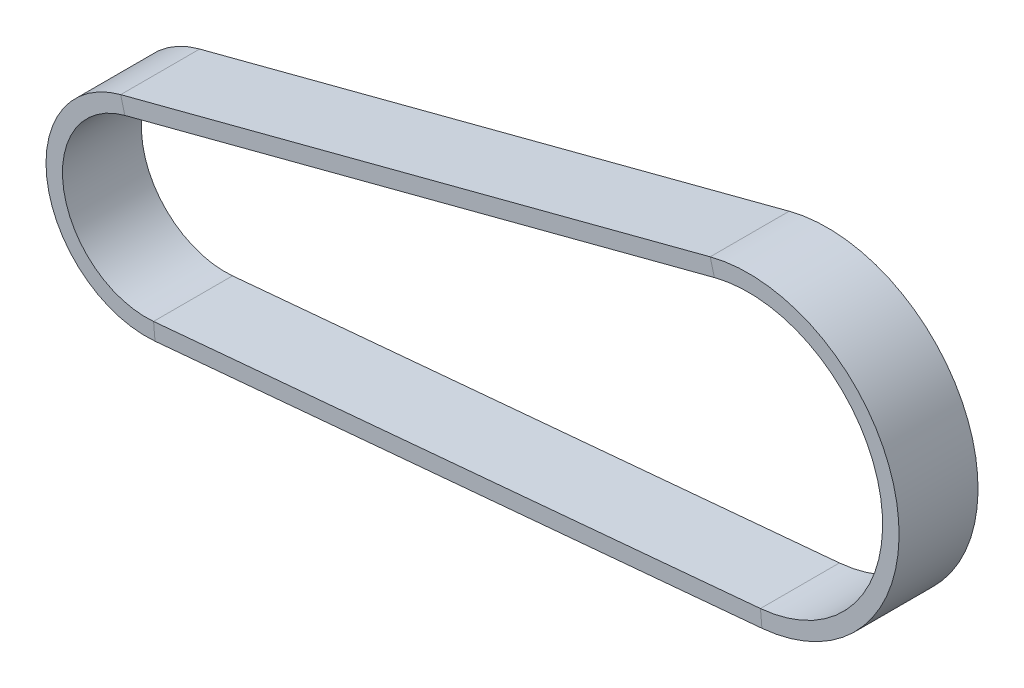
ISO-10303-21;
HEADER;
FILE_DESCRIPTION(('STEP AP214'),'2;1');
FILE_NAME('part.step','',(''),(''),'','','');
FILE_SCHEMA(('AUTOMOTIVE_DESIGN { 1 0 10303 214 1 1 1 1 }'));
ENDSEC;
DATA;
#1=APPLICATION_CONTEXT('core data for automotive mechanical design processes');
#2=APPLICATION_PROTOCOL_DEFINITION('international standard','automotive_design',2000,#1);
#3=PRODUCT_CONTEXT('',#1,'mechanical');
#4=PRODUCT('Part','Part','',(#3));
#5=PRODUCT_RELATED_PRODUCT_CATEGORY('part','',(#4));
#6=PRODUCT_DEFINITION_FORMATION('','',#4);
#7=PRODUCT_DEFINITION_CONTEXT('part definition',#1,'design');
#8=PRODUCT_DEFINITION('design','',#6,#7);
#9=PRODUCT_DEFINITION_SHAPE('','',#8);
#10=(LENGTH_UNIT() NAMED_UNIT(*) SI_UNIT(.MILLI.,.METRE.));
#11=(NAMED_UNIT(*) PLANE_ANGLE_UNIT() SI_UNIT($,.RADIAN.));
#12=(NAMED_UNIT(*) SI_UNIT($,.STERADIAN.) SOLID_ANGLE_UNIT());
#13=UNCERTAINTY_MEASURE_WITH_UNIT(LENGTH_MEASURE(1.E-05),#10,'distance_accuracy_value','');
#14=(GEOMETRIC_REPRESENTATION_CONTEXT(3) GLOBAL_UNCERTAINTY_ASSIGNED_CONTEXT((#13)) GLOBAL_UNIT_ASSIGNED_CONTEXT((#10,
#11,#12)) REPRESENTATION_CONTEXT('',''));
#15=CARTESIAN_POINT('',(0.,0.,0.));
#16=DIRECTION('',(0.,0.,1.));
#17=DIRECTION('',(1.,0.,0.));
#18=AXIS2_PLACEMENT_3D('',#15,#16,#17);
#19=CARTESIAN_POINT('',(-2.89942425296756,11.0768153817469,3.));
#20=DIRECTION('',(0.,0.,1.));
#21=DIRECTION('',(1.,0.,0.));
#22=AXIS2_PLACEMENT_3D('',#19,#20,#21);
#23=PLANE('',#22);
#24=CARTESIAN_POINT('',(0.,0.,3.));
#25=DIRECTION('',(0.,0.,-1.));
#26=DIRECTION('',(-0.253224825586686,0.967407456921122,0.));
#27=AXIS2_PLACEMENT_3D('',#24,#25,#26);
#28=CIRCLE('',#27,11.45);
#29=CARTESIAN_POINT('',(-2.89942425296755,11.0768153817469,3.));
#30=VERTEX_POINT('',#29);
#31=CARTESIAN_POINT('',(1.03013866200487,-11.4035658606001,3.));
#32=VERTEX_POINT('',#31);
#33=EDGE_CURVE('E11',#30,#32,#28,.T.);
#34=ORIENTED_EDGE('',*,*,#33,.F.);
#35=DIRECTION('',(0.253224825586685,-0.967407456921122,0.));
#36=VECTOR('',#35,1.);
#37=CARTESIAN_POINT('',(-2.89942425296755,11.0768153817469,3.));
#38=LINE('',#37,#36);
#39=CARTESIAN_POINT('',(-2.5828932209842,9.86755606059545,3.));
#40=VERTEX_POINT('',#39);
#41=EDGE_CURVE('E36',#30,#40,#38,.T.);
#42=ORIENTED_EDGE('',*,*,#41,.T.);
#43=CARTESIAN_POINT('',(0.,0.,3.));
#44=DIRECTION('',(0.,0.,-1.));
#45=DIRECTION('',(-0.253224825586686,0.967407456921122,0.));
#46=AXIS2_PLACEMENT_3D('',#43,#44,#45);
#47=CIRCLE('',#46,10.2);
#48=CARTESIAN_POINT('',(0.917678109384255,-10.1586350897922,3.));
#49=VERTEX_POINT('',#48);
#50=EDGE_CURVE('E118',#40,#49,#47,.T.);
#51=ORIENTED_EDGE('',*,*,#50,.T.);
#52=DIRECTION('',(-0.0899684420964954,0.995944616646292,0.));
#53=VECTOR('',#52,1.);
#54=CARTESIAN_POINT('',(1.03013866200487,-11.4035658606001,3.));
#55=LINE('',#54,#53);
#56=EDGE_CURVE('E121',#32,#49,#55,.T.);
#57=ORIENTED_EDGE('',*,*,#56,.F.);
#58=EDGE_LOOP('',(#34,#42,#51,#57));
#59=FACE_BOUND('',#58,.T.);
#60=ADVANCED_FACE('F33',(#59),#23,.T.);
#61=CARTESIAN_POINT('',(0.,0.,0.));
#62=DIRECTION('',(0.,0.,-1.));
#63=DIRECTION('',(-1.,0.,0.));
#64=AXIS2_PLACEMENT_3D('',#61,#62,#63);
#65=CYLINDRICAL_SURFACE('',#64,11.45);
#66=CARTESIAN_POINT('',(0.,0.,-3.));
#67=DIRECTION('',(0.,0.,-1.));
#68=DIRECTION('',(-0.253224825586686,0.967407456921122,0.));
#69=AXIS2_PLACEMENT_3D('',#66,#67,#68);
#70=CIRCLE('',#69,11.45);
#71=CARTESIAN_POINT('',(-2.89942425296755,11.0768153817469,-3.));
#72=VERTEX_POINT('',#71);
#73=CARTESIAN_POINT('',(1.03013866200487,-11.4035658606001,-3.));
#74=VERTEX_POINT('',#73);
#75=EDGE_CURVE('E41',#72,#74,#70,.T.);
#76=ORIENTED_EDGE('',*,*,#75,.F.);
#77=DIRECTION('',(0.,0.,1.));
#78=VECTOR('',#77,1.);
#79=CARTESIAN_POINT('',(-2.89942425296755,11.0768153817469,3.));
#80=LINE('',#79,#78);
#81=EDGE_CURVE('E187',#72,#30,#80,.T.);
#82=ORIENTED_EDGE('',*,*,#81,.T.);
#83=ORIENTED_EDGE('',*,*,#33,.T.);
#84=DIRECTION('',(0.,0.,1.));
#85=VECTOR('',#84,1.);
#86=CARTESIAN_POINT('',(1.03013866200487,-11.4035658606001,3.));
#87=LINE('',#86,#85);
#88=EDGE_CURVE('E146',#74,#32,#87,.T.);
#89=ORIENTED_EDGE('',*,*,#88,.F.);
#90=EDGE_LOOP('',(#76,#82,#83,#89));
#91=FACE_BOUND('',#90,.T.);
#92=ADVANCED_FACE('F227',(#91),#65,.T.);
#93=CARTESIAN_POINT('',(-2.89942425296755,11.0768153817469,-3.));
#94=DIRECTION('',(0.,0.,-1.));
#95=DIRECTION('',(-1.,0.,0.));
#96=AXIS2_PLACEMENT_3D('',#93,#94,#95);
#97=PLANE('',#96);
#98=CARTESIAN_POINT('',(0.,0.,-3.));
#99=DIRECTION('',(0.,0.,-1.));
#100=DIRECTION('',(-0.253224825586686,0.967407456921122,0.));
#101=AXIS2_PLACEMENT_3D('',#98,#99,#100);
#102=CIRCLE('',#101,10.2);
#103=CARTESIAN_POINT('',(-2.5828932209842,9.86755606059545,-3.));
#104=VERTEX_POINT('',#103);
#105=CARTESIAN_POINT('',(0.917678109384255,-10.1586350897922,-3.));
#106=VERTEX_POINT('',#105);
#107=EDGE_CURVE('E127',#104,#106,#102,.T.);
#108=ORIENTED_EDGE('',*,*,#107,.F.);
#109=DIRECTION('',(-0.253224825586685,0.967407456921122,0.));
#110=VECTOR('',#109,1.);
#111=CARTESIAN_POINT('',(-2.89942425296755,11.0768153817469,-3.));
#112=LINE('',#111,#110);
#113=EDGE_CURVE('E171',#104,#72,#112,.T.);
#114=ORIENTED_EDGE('',*,*,#113,.T.);
#115=ORIENTED_EDGE('',*,*,#75,.T.);
#116=DIRECTION('',(0.0899684420964956,-0.995944616646292,0.));
#117=VECTOR('',#116,1.);
#118=CARTESIAN_POINT('',(1.03013866200487,-11.4035658606001,-3.));
#119=LINE('',#118,#117);
#120=EDGE_CURVE('E151',#106,#74,#119,.T.);
#121=ORIENTED_EDGE('',*,*,#120,.F.);
#122=EDGE_LOOP('',(#108,#114,#115,#121));
#123=FACE_BOUND('',#122,.T.);
#124=ADVANCED_FACE('F223',(#123),#97,.T.);
#125=CARTESIAN_POINT('',(-47.691189048385,-0.647703327399525,3.));
#126=DIRECTION('',(0.,0.,1.));
#127=DIRECTION('',(1.,0.,0.));
#128=AXIS2_PLACEMENT_3D('',#125,#126,#127);
#129=PLANE('',#128);
#130=ORIENTED_EDGE('',*,*,#41,.F.);
#131=DIRECTION('',(0.967407456921122,0.253224825586685,0.));
#132=VECTOR('',#131,1.);
#133=CARTESIAN_POINT('',(-47.691189048385,-0.647703327399525,3.));
#134=LINE('',#133,#132);
#135=CARTESIAN_POINT('',(-47.691189048385,-0.647703327399528,3.));
#136=VERTEX_POINT('',#135);
#137=EDGE_CURVE('E49',#136,#30,#134,.T.);
#138=ORIENTED_EDGE('',*,*,#137,.F.);
#139=DIRECTION('',(0.253224825586685,-0.967407456921122,0.));
#140=VECTOR('',#139,1.);
#141=CARTESIAN_POINT('',(-47.691189048385,-0.647703327399525,3.));
#142=LINE('',#141,#140);
#143=CARTESIAN_POINT('',(-47.3746580164017,-1.85696264855093,3.));
#144=VERTEX_POINT('',#143);
#145=EDGE_CURVE('E175',#136,#144,#142,.T.);
#146=ORIENTED_EDGE('',*,*,#145,.T.);
#147=DIRECTION('',(0.967407456921122,0.253224825586685,0.));
#148=VECTOR('',#147,1.);
#149=CARTESIAN_POINT('',(-47.3746580164017,-1.85696264855093,3.));
#150=LINE('',#149,#148);
#151=EDGE_CURVE('E173',#144,#40,#150,.T.);
#152=ORIENTED_EDGE('',*,*,#151,.T.);
#153=EDGE_LOOP('',(#130,#138,#146,#152));
#154=FACE_BOUND('',#153,.T.);
#155=ADVANCED_FACE('F202',(#154),#129,.T.);
#156=CARTESIAN_POINT('',(-47.691189048385,-0.647703327399525,3.));
#157=DIRECTION('',(-0.253224825586685,0.967407456921122,0.));
#158=DIRECTION('',(-0.967407456921122,-0.253224825586685,0.));
#159=AXIS2_PLACEMENT_3D('',#156,#157,#158);
#160=PLANE('',#159);
#161=ORIENTED_EDGE('',*,*,#137,.T.);
#162=ORIENTED_EDGE('',*,*,#81,.F.);
#163=DIRECTION('',(0.967407456921122,0.253224825586685,0.));
#164=VECTOR('',#163,1.);
#165=CARTESIAN_POINT('',(-47.691189048385,-0.647703327399527,-3.));
#166=LINE('',#165,#164);
#167=CARTESIAN_POINT('',(-47.691189048385,-0.64770332739953,-3.));
#168=VERTEX_POINT('',#167);
#169=EDGE_CURVE('E58',#168,#72,#166,.T.);
#170=ORIENTED_EDGE('',*,*,#169,.F.);
#171=DIRECTION('',(0.,0.,1.));
#172=VECTOR('',#171,1.);
#173=CARTESIAN_POINT('',(-47.691189048385,-0.647703327399525,3.));
#174=LINE('',#173,#172);
#175=EDGE_CURVE('E184',#168,#136,#174,.T.);
#176=ORIENTED_EDGE('',*,*,#175,.T.);
#177=EDGE_LOOP('',(#161,#162,#170,#176));
#178=FACE_BOUND('',#177,.T.);
#179=ADVANCED_FACE('F213',(#178),#160,.T.);
#180=CARTESIAN_POINT('',(-47.691189048385,-0.647703327399527,-3.));
#181=DIRECTION('',(0.,0.,-1.));
#182=DIRECTION('',(-1.,0.,0.));
#183=AXIS2_PLACEMENT_3D('',#180,#181,#182);
#184=PLANE('',#183);
#185=ORIENTED_EDGE('',*,*,#169,.T.);
#186=ORIENTED_EDGE('',*,*,#113,.F.);
#187=DIRECTION('',(0.967407456921122,0.253224825586685,0.));
#188=VECTOR('',#187,1.);
#189=CARTESIAN_POINT('',(-47.3746580164017,-1.85696264855093,-3.));
#190=LINE('',#189,#188);
#191=CARTESIAN_POINT('',(-47.3746580164017,-1.85696264855093,-3.));
#192=VERTEX_POINT('',#191);
#193=EDGE_CURVE('E86',#192,#104,#190,.T.);
#194=ORIENTED_EDGE('',*,*,#193,.F.);
#195=DIRECTION('',(-0.253224825586685,0.967407456921122,0.));
#196=VECTOR('',#195,1.);
#197=CARTESIAN_POINT('',(-47.691189048385,-0.647703327399527,-3.));
#198=LINE('',#197,#196);
#199=EDGE_CURVE('E165',#192,#168,#198,.T.);
#200=ORIENTED_EDGE('',*,*,#199,.T.);
#201=EDGE_LOOP('',(#185,#186,#194,#200));
#202=FACE_BOUND('',#201,.T.);
#203=ADVANCED_FACE('F215',(#202),#184,.T.);
#204=CARTESIAN_POINT('',(-47.3746580164017,-1.85696264855093,3.));
#205=DIRECTION('',(0.253224825586685,-0.967407456921122,0.));
#206=DIRECTION('',(0.967407456921122,0.253224825586685,0.));
#207=AXIS2_PLACEMENT_3D('',#204,#205,#206);
#208=PLANE('',#207);
#209=ORIENTED_EDGE('',*,*,#193,.T.);
#210=DIRECTION('',(0.,0.,-1.));
#211=VECTOR('',#210,1.);
#212=CARTESIAN_POINT('',(-2.58289322098419,9.86755606059545,3.));
#213=LINE('',#212,#211);
#214=EDGE_CURVE('E169',#40,#104,#213,.T.);
#215=ORIENTED_EDGE('',*,*,#214,.F.);
#216=ORIENTED_EDGE('',*,*,#151,.F.);
#217=DIRECTION('',(0.,0.,-1.));
#218=VECTOR('',#217,1.);
#219=CARTESIAN_POINT('',(-47.3746580164017,-1.85696264855093,3.));
#220=LINE('',#219,#218);
#221=EDGE_CURVE('E160',#144,#192,#220,.T.);
#222=ORIENTED_EDGE('',*,*,#221,.T.);
#223=EDGE_LOOP('',(#209,#215,#216,#222));
#224=FACE_BOUND('',#223,.T.);
#225=ADVANCED_FACE('F221',(#224),#208,.T.);
#226=CARTESIAN_POINT('',(-45.0829202139929,-15.5691790865119,3.));
#227=DIRECTION('',(0.,0.,1.));
#228=DIRECTION('',(1.,0.,0.));
#229=AXIS2_PLACEMENT_3D('',#226,#227,#228);
#230=PLANE('',#229);
#231=ORIENTED_EDGE('',*,*,#145,.F.);
#232=CARTESIAN_POINT('',(-45.7666803739262,-8.00000000000006,3.));
#233=DIRECTION('',(0.,0.,-1.));
#234=DIRECTION('',(0.0899684420964952,-0.995944616646292,0.));
#235=AXIS2_PLACEMENT_3D('',#232,#233,#234);
#236=CIRCLE('',#235,7.60000000000001);
#237=CARTESIAN_POINT('',(-45.0829202139929,-15.5691790865119,3.));
#238=VERTEX_POINT('',#237);
#239=EDGE_CURVE('E194',#238,#136,#236,.T.);
#240=ORIENTED_EDGE('',*,*,#239,.F.);
#241=DIRECTION('',(-0.0899684420964954,0.995944616646292,0.));
#242=VECTOR('',#241,1.);
#243=CARTESIAN_POINT('',(-45.0829202139929,-15.5691790865119,3.));
#244=LINE('',#243,#242);
#245=CARTESIAN_POINT('',(-45.1953807666135,-14.324248315704,3.));
#246=VERTEX_POINT('',#245);
#247=EDGE_CURVE('E168',#238,#246,#244,.T.);
#248=ORIENTED_EDGE('',*,*,#247,.T.);
#249=CARTESIAN_POINT('',(-45.7666803739262,-8.00000000000006,3.));
#250=DIRECTION('',(0.,0.,-1.));
#251=DIRECTION('',(0.0899684420964954,-0.995944616646292,0.));
#252=AXIS2_PLACEMENT_3D('',#249,#250,#251);
#253=CIRCLE('',#252,6.35);
#254=EDGE_CURVE('E163',#246,#144,#253,.T.);
#255=ORIENTED_EDGE('',*,*,#254,.T.);
#256=EDGE_LOOP('',(#231,#240,#248,#255));
#257=FACE_BOUND('',#256,.T.);
#258=ADVANCED_FACE('F207',(#257),#230,.T.);
#259=CARTESIAN_POINT('',(-45.7666803739262,-8.00000000000006,0.));
#260=DIRECTION('',(0.,0.,-1.));
#261=DIRECTION('',(-1.,0.,0.));
#262=AXIS2_PLACEMENT_3D('',#259,#260,#261);
#263=CYLINDRICAL_SURFACE('',#262,7.6);
#264=ORIENTED_EDGE('',*,*,#239,.T.);
#265=ORIENTED_EDGE('',*,*,#175,.F.);
#266=CARTESIAN_POINT('',(-45.7666803739262,-8.00000000000006,-3.));
#267=DIRECTION('',(0.,0.,-1.));
#268=DIRECTION('',(0.0899684420964952,-0.995944616646292,0.));
#269=AXIS2_PLACEMENT_3D('',#266,#267,#268);
#270=CIRCLE('',#269,7.6);
#271=CARTESIAN_POINT('',(-45.0829202139929,-15.5691790865119,-3.));
#272=VERTEX_POINT('',#271);
#273=EDGE_CURVE('E99',#272,#168,#270,.T.);
#274=ORIENTED_EDGE('',*,*,#273,.F.);
#275=DIRECTION('',(0.,0.,1.));
#276=VECTOR('',#275,1.);
#277=CARTESIAN_POINT('',(-45.0829202139929,-15.5691790865119,3.));
#278=LINE('',#277,#276);
#279=EDGE_CURVE('E181',#272,#238,#278,.T.);
#280=ORIENTED_EDGE('',*,*,#279,.T.);
#281=EDGE_LOOP('',(#264,#265,#274,#280));
#282=FACE_BOUND('',#281,.T.);
#283=ADVANCED_FACE('F212',(#282),#263,.T.);
#284=CARTESIAN_POINT('',(-45.0829202139929,-15.5691790865119,-3.));
#285=DIRECTION('',(0.,0.,-1.));
#286=DIRECTION('',(-1.,0.,0.));
#287=AXIS2_PLACEMENT_3D('',#284,#285,#286);
#288=PLANE('',#287);
#289=ORIENTED_EDGE('',*,*,#273,.T.);
#290=ORIENTED_EDGE('',*,*,#199,.F.);
#291=CARTESIAN_POINT('',(-45.7666803739262,-8.00000000000006,-3.));
#292=DIRECTION('',(0.,0.,-1.));
#293=DIRECTION('',(0.0899684420964954,-0.995944616646292,0.));
#294=AXIS2_PLACEMENT_3D('',#291,#292,#293);
#295=CIRCLE('',#294,6.35);
#296=CARTESIAN_POINT('',(-45.1953807666135,-14.324248315704,-3.));
#297=VERTEX_POINT('',#296);
#298=EDGE_CURVE('E105',#297,#192,#295,.T.);
#299=ORIENTED_EDGE('',*,*,#298,.F.);
#300=DIRECTION('',(0.0899684420964956,-0.995944616646292,0.));
#301=VECTOR('',#300,1.);
#302=CARTESIAN_POINT('',(-45.0829202139929,-15.5691790865119,-3.));
#303=LINE('',#302,#301);
#304=EDGE_CURVE('E158',#297,#272,#303,.T.);
#305=ORIENTED_EDGE('',*,*,#304,.T.);
#306=EDGE_LOOP('',(#289,#290,#299,#305));
#307=FACE_BOUND('',#306,.T.);
#308=ADVANCED_FACE('F245',(#307),#288,.T.);
#309=CARTESIAN_POINT('',(-45.7666803739262,-8.00000000000006,0.));
#310=DIRECTION('',(0.,0.,-1.));
#311=DIRECTION('',(-1.,0.,0.));
#312=AXIS2_PLACEMENT_3D('',#309,#310,#311);
#313=CYLINDRICAL_SURFACE('',#312,6.35);
#314=ORIENTED_EDGE('',*,*,#298,.T.);
#315=ORIENTED_EDGE('',*,*,#221,.F.);
#316=ORIENTED_EDGE('',*,*,#254,.F.);
#317=DIRECTION('',(0.,0.,-1.));
#318=VECTOR('',#317,1.);
#319=CARTESIAN_POINT('',(-45.1953807666135,-14.324248315704,3.));
#320=LINE('',#319,#318);
#321=EDGE_CURVE('E138',#246,#297,#320,.T.);
#322=ORIENTED_EDGE('',*,*,#321,.T.);
#323=EDGE_LOOP('',(#314,#315,#316,#322));
#324=FACE_BOUND('',#323,.T.);
#325=ADVANCED_FACE('F205',(#324),#313,.F.);
#326=CARTESIAN_POINT('',(1.03013866200487,-11.4035658606001,3.));
#327=DIRECTION('',(0.,0.,1.));
#328=DIRECTION('',(1.,0.,0.));
#329=AXIS2_PLACEMENT_3D('',#326,#327,#328);
#330=PLANE('',#329);
#331=ORIENTED_EDGE('',*,*,#247,.F.);
#332=DIRECTION('',(-0.995944616646292,-0.0899684420964954,0.));
#333=VECTOR('',#332,1.);
#334=CARTESIAN_POINT('',(1.03013866200487,-11.4035658606001,3.));
#335=LINE('',#334,#333);
#336=EDGE_CURVE('E145',#32,#238,#335,.T.);
#337=ORIENTED_EDGE('',*,*,#336,.F.);
#338=ORIENTED_EDGE('',*,*,#56,.T.);
#339=DIRECTION('',(-0.995944616646292,-0.0899684420964954,0.));
#340=VECTOR('',#339,1.);
#341=CARTESIAN_POINT('',(0.917678109384255,-10.1586350897922,3.));
#342=LINE('',#341,#340);
#343=EDGE_CURVE('E133',#49,#246,#342,.T.);
#344=ORIENTED_EDGE('',*,*,#343,.T.);
#345=EDGE_LOOP('',(#331,#337,#338,#344));
#346=FACE_BOUND('',#345,.T.);
#347=ADVANCED_FACE('F143',(#346),#330,.T.);
#348=CARTESIAN_POINT('',(1.03013866200487,-11.4035658606001,3.));
#349=DIRECTION('',(0.0899684420964954,-0.995944616646292,0.));
#350=DIRECTION('',(0.995944616646292,0.0899684420964955,0.));
#351=AXIS2_PLACEMENT_3D('',#348,#349,#350);
#352=PLANE('',#351);
#353=ORIENTED_EDGE('',*,*,#336,.T.);
#354=ORIENTED_EDGE('',*,*,#279,.F.);
#355=DIRECTION('',(-0.995944616646292,-0.0899684420964954,0.));
#356=VECTOR('',#355,1.);
#357=CARTESIAN_POINT('',(1.03013866200487,-11.4035658606001,-3.));
#358=LINE('',#357,#356);
#359=EDGE_CURVE('E178',#74,#272,#358,.T.);
#360=ORIENTED_EDGE('',*,*,#359,.F.);
#361=ORIENTED_EDGE('',*,*,#88,.T.);
#362=EDGE_LOOP('',(#353,#354,#360,#361));
#363=FACE_BOUND('',#362,.T.);
#364=ADVANCED_FACE('F209',(#363),#352,.T.);
#365=CARTESIAN_POINT('',(1.03013866200487,-11.4035658606001,-3.));
#366=DIRECTION('',(0.,0.,-1.));
#367=DIRECTION('',(-1.,0.,0.));
#368=AXIS2_PLACEMENT_3D('',#365,#366,#367);
#369=PLANE('',#368);
#370=ORIENTED_EDGE('',*,*,#359,.T.);
#371=ORIENTED_EDGE('',*,*,#304,.F.);
#372=DIRECTION('',(-0.995944616646292,-0.0899684420964954,0.));
#373=VECTOR('',#372,1.);
#374=CARTESIAN_POINT('',(0.917678109384255,-10.1586350897922,-3.));
#375=LINE('',#374,#373);
#376=EDGE_CURVE('E157',#106,#297,#375,.T.);
#377=ORIENTED_EDGE('',*,*,#376,.F.);
#378=ORIENTED_EDGE('',*,*,#120,.T.);
#379=EDGE_LOOP('',(#370,#371,#377,#378));
#380=FACE_BOUND('',#379,.T.);
#381=ADVANCED_FACE('F254',(#380),#369,.T.);
#382=CARTESIAN_POINT('',(0.917678109384255,-10.1586350897922,3.));
#383=DIRECTION('',(-0.0899684420964954,0.995944616646292,0.));
#384=DIRECTION('',(-0.995944616646292,-0.0899684420964955,0.));
#385=AXIS2_PLACEMENT_3D('',#382,#383,#384);
#386=PLANE('',#385);
#387=ORIENTED_EDGE('',*,*,#376,.T.);
#388=ORIENTED_EDGE('',*,*,#321,.F.);
#389=ORIENTED_EDGE('',*,*,#343,.F.);
#390=DIRECTION('',(0.,0.,-1.));
#391=VECTOR('',#390,1.);
#392=CARTESIAN_POINT('',(0.917678109384255,-10.1586350897922,3.));
#393=LINE('',#392,#391);
#394=EDGE_CURVE('E136',#49,#106,#393,.T.);
#395=ORIENTED_EDGE('',*,*,#394,.T.);
#396=EDGE_LOOP('',(#387,#388,#389,#395));
#397=FACE_BOUND('',#396,.T.);
#398=ADVANCED_FACE('F135',(#397),#386,.T.);
#399=CARTESIAN_POINT('',(0.,0.,0.));
#400=DIRECTION('',(0.,0.,-1.));
#401=DIRECTION('',(-1.,0.,0.));
#402=AXIS2_PLACEMENT_3D('',#399,#400,#401);
#403=CYLINDRICAL_SURFACE('',#402,10.2);
#404=ORIENTED_EDGE('',*,*,#214,.T.);
#405=ORIENTED_EDGE('',*,*,#107,.T.);
#406=ORIENTED_EDGE('',*,*,#394,.F.);
#407=ORIENTED_EDGE('',*,*,#50,.F.);
#408=EDGE_LOOP('',(#404,#405,#406,#407));
#409=FACE_BOUND('',#408,.T.);
#410=ADVANCED_FACE('F148',(#409),#403,.F.);
#411=CLOSED_SHELL('',(#60,#92,#124,#155,#179,#203,#225,#258,#283,#308,#325,#347,#364,#381,#398,#410));
#412=MANIFOLD_SOLID_BREP('B2',#411);
#413=ADVANCED_BREP_SHAPE_REPRESENTATION('',(#18,#412),#14);
#414=SHAPE_DEFINITION_REPRESENTATION(#9,#413);
ENDSEC;
END-ISO-10303-21;
